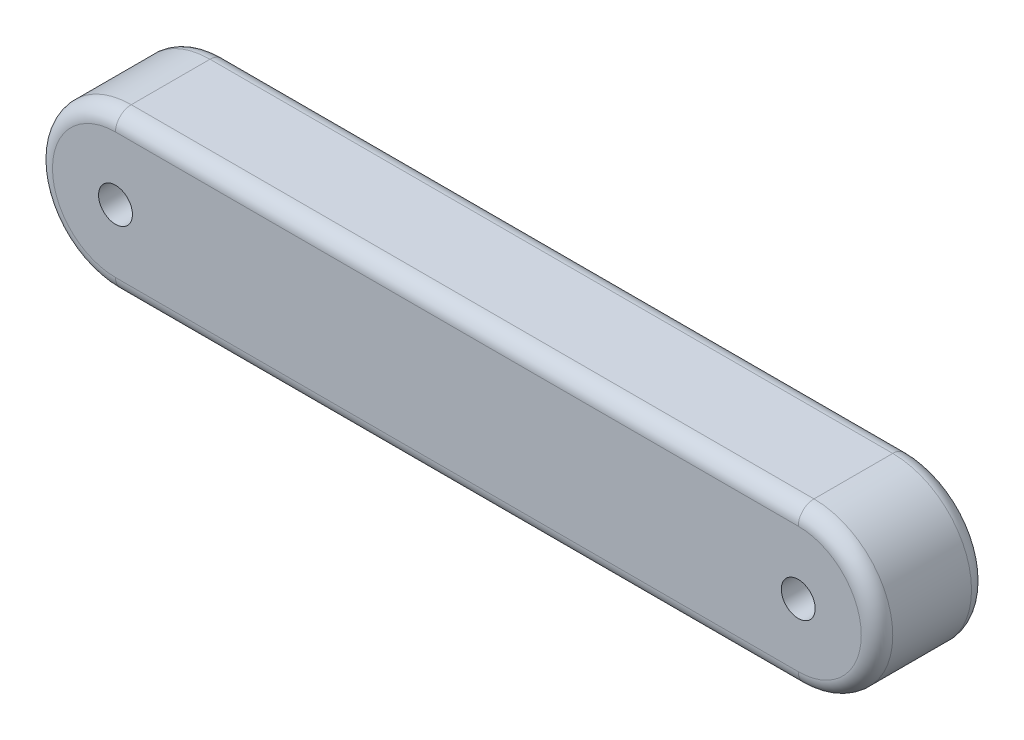
ISO-10303-21;
HEADER;
FILE_DESCRIPTION(('STEP AP214'),'2;1');
FILE_NAME('part.step','',(''),(''),'','','');
FILE_SCHEMA(('AUTOMOTIVE_DESIGN { 1 0 10303 214 1 1 1 1 }'));
ENDSEC;
DATA;
#1=APPLICATION_CONTEXT('core data for automotive mechanical design processes');
#2=APPLICATION_PROTOCOL_DEFINITION('international standard','automotive_design',2000,#1);
#3=PRODUCT_CONTEXT('',#1,'mechanical');
#4=PRODUCT('Part','Part','',(#3));
#5=PRODUCT_RELATED_PRODUCT_CATEGORY('part','',(#4));
#6=PRODUCT_DEFINITION_FORMATION('','',#4);
#7=PRODUCT_DEFINITION_CONTEXT('part definition',#1,'design');
#8=PRODUCT_DEFINITION('design','',#6,#7);
#9=PRODUCT_DEFINITION_SHAPE('','',#8);
#10=(LENGTH_UNIT() NAMED_UNIT(*) SI_UNIT(.MILLI.,.METRE.));
#11=(NAMED_UNIT(*) PLANE_ANGLE_UNIT() SI_UNIT($,.RADIAN.));
#12=(NAMED_UNIT(*) SI_UNIT($,.STERADIAN.) SOLID_ANGLE_UNIT());
#13=UNCERTAINTY_MEASURE_WITH_UNIT(LENGTH_MEASURE(1.E-05),#10,'distance_accuracy_value','');
#14=(GEOMETRIC_REPRESENTATION_CONTEXT(3) GLOBAL_UNCERTAINTY_ASSIGNED_CONTEXT((#13)) GLOBAL_UNIT_ASSIGNED_CONTEXT((#10,
#11,#12)) REPRESENTATION_CONTEXT('',''));
#15=CARTESIAN_POINT('',(0.,0.,0.));
#16=DIRECTION('',(0.,0.,1.));
#17=DIRECTION('',(1.,0.,0.));
#18=AXIS2_PLACEMENT_3D('',#15,#16,#17);
#19=CARTESIAN_POINT('',(43.345,0.,14.));
#20=DIRECTION('',(0.,0.,-1.));
#21=DIRECTION('',(-1.,0.,0.));
#22=AXIS2_PLACEMENT_3D('',#19,#20,#21);
#23=PLANE('',#22);
#24=DIRECTION('',(1.,0.,0.));
#25=VECTOR('',#24,1.);
#26=CARTESIAN_POINT('',(43.345,-8.00000000000001,14.));
#27=LINE('',#26,#25);
#28=CARTESIAN_POINT('',(-43.345,-8.00000000000002,14.));
#29=VERTEX_POINT('',#28);
#30=CARTESIAN_POINT('',(43.345,-8.00000000000001,14.));
#31=VERTEX_POINT('',#30);
#32=EDGE_CURVE('E133',#29,#31,#27,.T.);
#33=ORIENTED_EDGE('',*,*,#32,.T.);
#34=CARTESIAN_POINT('',(43.345,0.,14.));
#35=DIRECTION('',(0.,0.,-1.));
#36=DIRECTION('',(-1.,0.,0.));
#37=AXIS2_PLACEMENT_3D('',#34,#35,#36);
#38=CIRCLE('',#37,8.);
#39=CARTESIAN_POINT('',(43.345,7.99999999999999,14.));
#40=VERTEX_POINT('',#39);
#41=EDGE_CURVE('E114',#31,#40,#38,.F.);
#42=ORIENTED_EDGE('',*,*,#41,.T.);
#43=DIRECTION('',(-1.,0.,0.));
#44=VECTOR('',#43,1.);
#45=CARTESIAN_POINT('',(43.345,7.99999999999999,14.));
#46=LINE('',#45,#44);
#47=CARTESIAN_POINT('',(-43.345,7.99999999999998,14.));
#48=VERTEX_POINT('',#47);
#49=EDGE_CURVE('E122',#40,#48,#46,.T.);
#50=ORIENTED_EDGE('',*,*,#49,.T.);
#51=CARTESIAN_POINT('',(-43.345,0.,14.));
#52=DIRECTION('',(0.,0.,-1.));
#53=DIRECTION('',(-1.,0.,0.));
#54=AXIS2_PLACEMENT_3D('',#51,#52,#53);
#55=CIRCLE('',#54,8.);
#56=EDGE_CURVE('E128',#48,#29,#55,.F.);
#57=ORIENTED_EDGE('',*,*,#56,.T.);
#58=EDGE_LOOP('',(#33,#42,#50,#57));
#59=FACE_BOUND('',#58,.T.);
#60=CARTESIAN_POINT('',(-43.345,0.,14.));
#61=DIRECTION('',(0.,0.,1.));
#62=DIRECTION('',(1.,0.,0.));
#63=AXIS2_PLACEMENT_3D('',#60,#61,#62);
#64=CIRCLE('',#63,2.15);
#65=CARTESIAN_POINT('',(-41.195,0.,14.));
#66=VERTEX_POINT('',#65);
#67=EDGE_CURVE('E212',#66,#66,#64,.T.);
#68=ORIENTED_EDGE('',*,*,#67,.F.);
#69=EDGE_LOOP('',(#68));
#70=FACE_BOUND('',#69,.T.);
#71=CARTESIAN_POINT('',(43.345,0.,14.));
#72=DIRECTION('',(0.,0.,1.));
#73=DIRECTION('',(-1.,0.,0.));
#74=AXIS2_PLACEMENT_3D('',#71,#72,#73);
#75=CIRCLE('',#74,2.15);
#76=CARTESIAN_POINT('',(41.195,0.,14.));
#77=VERTEX_POINT('',#76);
#78=EDGE_CURVE('E219',#77,#77,#75,.T.);
#79=ORIENTED_EDGE('',*,*,#78,.F.);
#80=EDGE_LOOP('',(#79));
#81=FACE_BOUND('',#80,.T.);
#82=ADVANCED_FACE('F41',(#59,#70,#81),#23,.F.);
#83=CARTESIAN_POINT('',(43.345,0.,0.));
#84=DIRECTION('',(0.,0.,-1.));
#85=DIRECTION('',(-1.,0.,0.));
#86=AXIS2_PLACEMENT_3D('',#83,#84,#85);
#87=PLANE('',#86);
#88=DIRECTION('',(-1.,0.,0.));
#89=VECTOR('',#88,1.);
#90=CARTESIAN_POINT('',(43.345,7.99999999999999,0.));
#91=LINE('',#90,#89);
#92=CARTESIAN_POINT('',(-43.345,7.99999999999998,0.));
#93=VERTEX_POINT('',#92);
#94=CARTESIAN_POINT('',(43.345,7.99999999999999,0.));
#95=VERTEX_POINT('',#94);
#96=EDGE_CURVE('E151',#93,#95,#91,.F.);
#97=ORIENTED_EDGE('',*,*,#96,.T.);
#98=CARTESIAN_POINT('',(43.345,0.,0.));
#99=DIRECTION('',(0.,0.,-1.));
#100=DIRECTION('',(-1.,0.,0.));
#101=AXIS2_PLACEMENT_3D('',#98,#99,#100);
#102=CIRCLE('',#101,8.);
#103=CARTESIAN_POINT('',(43.345,-8.00000000000001,0.));
#104=VERTEX_POINT('',#103);
#105=EDGE_CURVE('E156',#95,#104,#102,.T.);
#106=ORIENTED_EDGE('',*,*,#105,.T.);
#107=DIRECTION('',(1.,0.,0.));
#108=VECTOR('',#107,1.);
#109=CARTESIAN_POINT('',(-43.345,-8.00000000000002,0.));
#110=LINE('',#109,#108);
#111=CARTESIAN_POINT('',(-43.345,-8.00000000000002,0.));
#112=VERTEX_POINT('',#111);
#113=EDGE_CURVE('E65',#104,#112,#110,.F.);
#114=ORIENTED_EDGE('',*,*,#113,.T.);
#115=CARTESIAN_POINT('',(-43.345,0.,0.));
#116=DIRECTION('',(0.,0.,-1.));
#117=DIRECTION('',(-1.,0.,0.));
#118=AXIS2_PLACEMENT_3D('',#115,#116,#117);
#119=CIRCLE('',#118,8.);
#120=EDGE_CURVE('E153',#112,#93,#119,.T.);
#121=ORIENTED_EDGE('',*,*,#120,.T.);
#122=EDGE_LOOP('',(#97,#106,#114,#121));
#123=FACE_BOUND('',#122,.T.);
#124=CARTESIAN_POINT('',(-43.345,0.,0.));
#125=DIRECTION('',(0.,0.,1.));
#126=DIRECTION('',(1.,0.,0.));
#127=AXIS2_PLACEMENT_3D('',#124,#125,#126);
#128=CIRCLE('',#127,2.15);
#129=CARTESIAN_POINT('',(-41.195,0.,0.));
#130=VERTEX_POINT('',#129);
#131=EDGE_CURVE('E215',#130,#130,#128,.T.);
#132=ORIENTED_EDGE('',*,*,#131,.T.);
#133=EDGE_LOOP('',(#132));
#134=FACE_BOUND('',#133,.T.);
#135=CARTESIAN_POINT('',(43.345,0.,0.));
#136=DIRECTION('',(0.,0.,1.));
#137=DIRECTION('',(-1.,0.,0.));
#138=AXIS2_PLACEMENT_3D('',#135,#136,#137);
#139=CIRCLE('',#138,2.15);
#140=CARTESIAN_POINT('',(41.195,0.,0.));
#141=VERTEX_POINT('',#140);
#142=EDGE_CURVE('E164',#141,#141,#139,.T.);
#143=ORIENTED_EDGE('',*,*,#142,.T.);
#144=EDGE_LOOP('',(#143));
#145=FACE_BOUND('',#144,.T.);
#146=ADVANCED_FACE('F180',(#123,#134,#145),#87,.T.);
#147=CARTESIAN_POINT('',(43.345,0.,14.));
#148=DIRECTION('',(0.,0.,-1.));
#149=DIRECTION('',(-1.,0.,0.));
#150=AXIS2_PLACEMENT_3D('',#147,#148,#149);
#151=CYLINDRICAL_SURFACE('',#150,10.);
#152=DIRECTION('',(0.,0.,-1.));
#153=VECTOR('',#152,1.);
#154=CARTESIAN_POINT('',(43.345,9.99999999999999,14.));
#155=LINE('',#154,#153);
#156=CARTESIAN_POINT('',(43.345,9.99999999999999,12.));
#157=VERTEX_POINT('',#156);
#158=CARTESIAN_POINT('',(43.345,9.99999999999999,2.));
#159=VERTEX_POINT('',#158);
#160=EDGE_CURVE('E129',#157,#159,#155,.T.);
#161=ORIENTED_EDGE('',*,*,#160,.F.);
#162=CARTESIAN_POINT('',(43.345,0.,12.));
#163=DIRECTION('',(0.,0.,-1.));
#164=DIRECTION('',(-1.,0.,0.));
#165=AXIS2_PLACEMENT_3D('',#162,#163,#164);
#166=CIRCLE('',#165,10.);
#167=CARTESIAN_POINT('',(43.345,-10.,12.));
#168=VERTEX_POINT('',#167);
#169=EDGE_CURVE('E116',#157,#168,#166,.T.);
#170=ORIENTED_EDGE('',*,*,#169,.T.);
#171=DIRECTION('',(0.,0.,-1.));
#172=VECTOR('',#171,1.);
#173=CARTESIAN_POINT('',(43.345,-10.,14.));
#174=LINE('',#173,#172);
#175=CARTESIAN_POINT('',(43.345,-10.,2.));
#176=VERTEX_POINT('',#175);
#177=EDGE_CURVE('E194',#168,#176,#174,.T.);
#178=ORIENTED_EDGE('',*,*,#177,.T.);
#179=CARTESIAN_POINT('',(43.345,0.,2.));
#180=DIRECTION('',(0.,0.,-1.));
#181=DIRECTION('',(-1.,0.,0.));
#182=AXIS2_PLACEMENT_3D('',#179,#180,#181);
#183=CIRCLE('',#182,10.);
#184=EDGE_CURVE('E135',#176,#159,#183,.F.);
#185=ORIENTED_EDGE('',*,*,#184,.T.);
#186=EDGE_LOOP('',(#161,#170,#178,#185));
#187=FACE_BOUND('',#186,.T.);
#188=ADVANCED_FACE('F192',(#187),#151,.T.);
#189=CARTESIAN_POINT('',(-43.345,9.99999999999998,14.));
#190=DIRECTION('',(0.,-1.,0.));
#191=DIRECTION('',(1.,0.,0.));
#192=AXIS2_PLACEMENT_3D('',#189,#190,#191);
#193=PLANE('',#192);
#194=DIRECTION('',(0.,0.,-1.));
#195=VECTOR('',#194,1.);
#196=CARTESIAN_POINT('',(-43.345,9.99999999999998,14.));
#197=LINE('',#196,#195);
#198=CARTESIAN_POINT('',(-43.345,9.99999999999998,12.));
#199=VERTEX_POINT('',#198);
#200=CARTESIAN_POINT('',(-43.345,9.99999999999998,2.));
#201=VERTEX_POINT('',#200);
#202=EDGE_CURVE('E196',#199,#201,#197,.T.);
#203=ORIENTED_EDGE('',*,*,#202,.F.);
#204=DIRECTION('',(-1.,0.,0.));
#205=VECTOR('',#204,1.);
#206=CARTESIAN_POINT('',(-43.345,9.99999999999998,12.));
#207=LINE('',#206,#205);
#208=EDGE_CURVE('E11',#199,#157,#207,.F.);
#209=ORIENTED_EDGE('',*,*,#208,.T.);
#210=ORIENTED_EDGE('',*,*,#160,.T.);
#211=DIRECTION('',(-1.,0.,0.));
#212=VECTOR('',#211,1.);
#213=CARTESIAN_POINT('',(-43.345,9.99999999999998,2.));
#214=LINE('',#213,#212);
#215=EDGE_CURVE('E50',#159,#201,#214,.T.);
#216=ORIENTED_EDGE('',*,*,#215,.T.);
#217=EDGE_LOOP('',(#203,#209,#210,#216));
#218=FACE_BOUND('',#217,.T.);
#219=ADVANCED_FACE('F195',(#218),#193,.F.);
#220=CARTESIAN_POINT('',(-43.345,0.,14.));
#221=DIRECTION('',(0.,0.,-1.));
#222=DIRECTION('',(-1.,0.,0.));
#223=AXIS2_PLACEMENT_3D('',#220,#221,#222);
#224=CYLINDRICAL_SURFACE('',#223,10.);
#225=DIRECTION('',(0.,0.,-1.));
#226=VECTOR('',#225,1.);
#227=CARTESIAN_POINT('',(-43.345,-10.,14.));
#228=LINE('',#227,#226);
#229=CARTESIAN_POINT('',(-43.345,-10.,12.));
#230=VERTEX_POINT('',#229);
#231=CARTESIAN_POINT('',(-43.345,-10.,2.));
#232=VERTEX_POINT('',#231);
#233=EDGE_CURVE('E198',#230,#232,#228,.T.);
#234=ORIENTED_EDGE('',*,*,#233,.F.);
#235=CARTESIAN_POINT('',(-43.345,0.,12.));
#236=DIRECTION('',(0.,0.,-1.));
#237=DIRECTION('',(-1.,0.,0.));
#238=AXIS2_PLACEMENT_3D('',#235,#236,#237);
#239=CIRCLE('',#238,10.);
#240=EDGE_CURVE('E149',#230,#199,#239,.T.);
#241=ORIENTED_EDGE('',*,*,#240,.T.);
#242=ORIENTED_EDGE('',*,*,#202,.T.);
#243=CARTESIAN_POINT('',(-43.345,0.,2.));
#244=DIRECTION('',(0.,0.,-1.));
#245=DIRECTION('',(-1.,0.,0.));
#246=AXIS2_PLACEMENT_3D('',#243,#244,#245);
#247=CIRCLE('',#246,10.);
#248=EDGE_CURVE('E147',#201,#232,#247,.F.);
#249=ORIENTED_EDGE('',*,*,#248,.T.);
#250=EDGE_LOOP('',(#234,#241,#242,#249));
#251=FACE_BOUND('',#250,.T.);
#252=ADVANCED_FACE('F242',(#251),#224,.T.);
#253=CARTESIAN_POINT('',(-43.345,-10.,14.));
#254=DIRECTION('',(0.,1.,0.));
#255=DIRECTION('',(-1.,0.,0.));
#256=AXIS2_PLACEMENT_3D('',#253,#254,#255);
#257=PLANE('',#256);
#258=ORIENTED_EDGE('',*,*,#177,.F.);
#259=DIRECTION('',(1.,0.,0.));
#260=VECTOR('',#259,1.);
#261=CARTESIAN_POINT('',(-43.345,-10.,12.));
#262=LINE('',#261,#260);
#263=EDGE_CURVE('E145',#168,#230,#262,.F.);
#264=ORIENTED_EDGE('',*,*,#263,.T.);
#265=ORIENTED_EDGE('',*,*,#233,.T.);
#266=DIRECTION('',(1.,0.,0.));
#267=VECTOR('',#266,1.);
#268=CARTESIAN_POINT('',(43.345,-10.,2.));
#269=LINE('',#268,#267);
#270=EDGE_CURVE('E143',#232,#176,#269,.T.);
#271=ORIENTED_EDGE('',*,*,#270,.T.);
#272=EDGE_LOOP('',(#258,#264,#265,#271));
#273=FACE_BOUND('',#272,.T.);
#274=ADVANCED_FACE('F211',(#273),#257,.F.);
#275=CARTESIAN_POINT('',(-43.345,0.,14.));
#276=DIRECTION('',(0.,0.,-1.));
#277=DIRECTION('',(-1.,0.,0.));
#278=AXIS2_PLACEMENT_3D('',#275,#276,#277);
#279=CYLINDRICAL_SURFACE('',#278,2.15);
#280=ORIENTED_EDGE('',*,*,#67,.T.);
#281=EDGE_LOOP('',(#280));
#282=FACE_BOUND('',#281,.T.);
#283=ORIENTED_EDGE('',*,*,#131,.F.);
#284=EDGE_LOOP('',(#283));
#285=FACE_BOUND('',#284,.T.);
#286=ADVANCED_FACE('F237',(#282,#285),#279,.F.);
#287=CARTESIAN_POINT('',(43.345,0.,14.));
#288=DIRECTION('',(0.,0.,-1.));
#289=DIRECTION('',(-1.,0.,0.));
#290=AXIS2_PLACEMENT_3D('',#287,#288,#289);
#291=CYLINDRICAL_SURFACE('',#290,2.15);
#292=ORIENTED_EDGE('',*,*,#78,.T.);
#293=EDGE_LOOP('',(#292));
#294=FACE_BOUND('',#293,.T.);
#295=ORIENTED_EDGE('',*,*,#142,.F.);
#296=EDGE_LOOP('',(#295));
#297=FACE_BOUND('',#296,.T.);
#298=ADVANCED_FACE('F226',(#294,#297),#291,.F.);
#299=CARTESIAN_POINT('',(-43.345,0.,12.));
#300=DIRECTION('',(0.,0.,-1.));
#301=DIRECTION('',(-1.,0.,0.));
#302=AXIS2_PLACEMENT_3D('',#299,#300,#301);
#303=TOROIDAL_SURFACE('',#302,8.,2.);
#304=CARTESIAN_POINT('',(-43.345,7.99999999999998,12.));
#305=DIRECTION('',(1.,0.,0.));
#306=DIRECTION('',(0.,0.,-1.));
#307=AXIS2_PLACEMENT_3D('',#304,#305,#306);
#308=CIRCLE('',#307,2.);
#309=EDGE_CURVE('E125',#199,#48,#308,.T.);
#310=ORIENTED_EDGE('',*,*,#309,.F.);
#311=ORIENTED_EDGE('',*,*,#240,.F.);
#312=CARTESIAN_POINT('',(-43.345,-8.00000000000002,12.));
#313=DIRECTION('',(1.,0.,0.));
#314=DIRECTION('',(0.,0.,-1.));
#315=AXIS2_PLACEMENT_3D('',#312,#313,#314);
#316=CIRCLE('',#315,2.);
#317=EDGE_CURVE('E161',#29,#230,#316,.T.);
#318=ORIENTED_EDGE('',*,*,#317,.F.);
#319=ORIENTED_EDGE('',*,*,#56,.F.);
#320=EDGE_LOOP('',(#310,#311,#318,#319));
#321=FACE_BOUND('',#320,.T.);
#322=ADVANCED_FACE('F204',(#321),#303,.T.);
#323=CARTESIAN_POINT('',(43.345,-8.00000000000001,12.));
#324=DIRECTION('',(1.,0.,0.));
#325=DIRECTION('',(0.,1.,0.));
#326=AXIS2_PLACEMENT_3D('',#323,#324,#325);
#327=CYLINDRICAL_SURFACE('',#326,2.);
#328=ORIENTED_EDGE('',*,*,#317,.T.);
#329=ORIENTED_EDGE('',*,*,#263,.F.);
#330=CARTESIAN_POINT('',(43.345,-8.00000000000001,12.));
#331=DIRECTION('',(1.,0.,0.));
#332=DIRECTION('',(0.,1.,0.));
#333=AXIS2_PLACEMENT_3D('',#330,#331,#332);
#334=CIRCLE('',#333,2.);
#335=EDGE_CURVE('E119',#31,#168,#334,.T.);
#336=ORIENTED_EDGE('',*,*,#335,.F.);
#337=ORIENTED_EDGE('',*,*,#32,.F.);
#338=EDGE_LOOP('',(#328,#329,#336,#337));
#339=FACE_BOUND('',#338,.T.);
#340=ADVANCED_FACE('F207',(#339),#327,.T.);
#341=CARTESIAN_POINT('',(43.345,7.99999999999999,12.));
#342=DIRECTION('',(-1.,0.,0.));
#343=DIRECTION('',(0.,-1.,0.));
#344=AXIS2_PLACEMENT_3D('',#341,#342,#343);
#345=CYLINDRICAL_SURFACE('',#344,2.);
#346=ORIENTED_EDGE('',*,*,#309,.T.);
#347=ORIENTED_EDGE('',*,*,#49,.F.);
#348=CARTESIAN_POINT('',(43.345,7.99999999999999,12.));
#349=DIRECTION('',(1.,0.,0.));
#350=DIRECTION('',(0.,0.,-1.));
#351=AXIS2_PLACEMENT_3D('',#348,#349,#350);
#352=CIRCLE('',#351,2.);
#353=EDGE_CURVE('E110',#157,#40,#352,.T.);
#354=ORIENTED_EDGE('',*,*,#353,.F.);
#355=ORIENTED_EDGE('',*,*,#208,.F.);
#356=EDGE_LOOP('',(#346,#347,#354,#355));
#357=FACE_BOUND('',#356,.T.);
#358=ADVANCED_FACE('F123',(#357),#345,.T.);
#359=CARTESIAN_POINT('',(43.345,0.,12.));
#360=DIRECTION('',(0.,0.,-1.));
#361=DIRECTION('',(-1.,0.,0.));
#362=AXIS2_PLACEMENT_3D('',#359,#360,#361);
#363=TOROIDAL_SURFACE('',#362,8.,2.);
#364=ORIENTED_EDGE('',*,*,#335,.T.);
#365=ORIENTED_EDGE('',*,*,#169,.F.);
#366=ORIENTED_EDGE('',*,*,#353,.T.);
#367=ORIENTED_EDGE('',*,*,#41,.F.);
#368=EDGE_LOOP('',(#364,#365,#366,#367));
#369=FACE_BOUND('',#368,.T.);
#370=ADVANCED_FACE('F112',(#369),#363,.T.);
#371=CARTESIAN_POINT('',(-43.345,0.,2.));
#372=DIRECTION('',(0.,0.,-1.));
#373=DIRECTION('',(-1.,0.,0.));
#374=AXIS2_PLACEMENT_3D('',#371,#372,#373);
#375=TOROIDAL_SURFACE('',#374,8.,2.);
#376=CARTESIAN_POINT('',(-43.345,7.99999999999998,2.));
#377=DIRECTION('',(1.,0.,0.));
#378=DIRECTION('',(0.,0.,-1.));
#379=AXIS2_PLACEMENT_3D('',#376,#377,#378);
#380=CIRCLE('',#379,2.);
#381=EDGE_CURVE('E167',#93,#201,#380,.T.);
#382=ORIENTED_EDGE('',*,*,#381,.F.);
#383=ORIENTED_EDGE('',*,*,#120,.F.);
#384=CARTESIAN_POINT('',(-43.345,-8.00000000000002,2.));
#385=DIRECTION('',(1.,0.,0.));
#386=DIRECTION('',(0.,0.,-1.));
#387=AXIS2_PLACEMENT_3D('',#384,#385,#386);
#388=CIRCLE('',#387,2.);
#389=EDGE_CURVE('E45',#232,#112,#388,.T.);
#390=ORIENTED_EDGE('',*,*,#389,.F.);
#391=ORIENTED_EDGE('',*,*,#248,.F.);
#392=EDGE_LOOP('',(#382,#383,#390,#391));
#393=FACE_BOUND('',#392,.T.);
#394=ADVANCED_FACE('F43',(#393),#375,.T.);
#395=CARTESIAN_POINT('',(-43.345,-8.00000000000002,2.));
#396=DIRECTION('',(-1.,0.,0.));
#397=DIRECTION('',(0.,-1.,0.));
#398=AXIS2_PLACEMENT_3D('',#395,#396,#397);
#399=CYLINDRICAL_SURFACE('',#398,2.);
#400=ORIENTED_EDGE('',*,*,#389,.T.);
#401=ORIENTED_EDGE('',*,*,#113,.F.);
#402=CARTESIAN_POINT('',(43.345,-8.00000000000001,2.));
#403=DIRECTION('',(1.,0.,0.));
#404=DIRECTION('',(0.,0.,-1.));
#405=AXIS2_PLACEMENT_3D('',#402,#403,#404);
#406=CIRCLE('',#405,2.);
#407=EDGE_CURVE('E58',#176,#104,#406,.T.);
#408=ORIENTED_EDGE('',*,*,#407,.F.);
#409=ORIENTED_EDGE('',*,*,#270,.F.);
#410=EDGE_LOOP('',(#400,#401,#408,#409));
#411=FACE_BOUND('',#410,.T.);
#412=ADVANCED_FACE('F177',(#411),#399,.T.);
#413=CARTESIAN_POINT('',(-43.345,7.99999999999998,2.));
#414=DIRECTION('',(1.,0.,0.));
#415=DIRECTION('',(0.,1.,0.));
#416=AXIS2_PLACEMENT_3D('',#413,#414,#415);
#417=CYLINDRICAL_SURFACE('',#416,2.);
#418=ORIENTED_EDGE('',*,*,#381,.T.);
#419=ORIENTED_EDGE('',*,*,#215,.F.);
#420=CARTESIAN_POINT('',(43.345,7.99999999999999,2.));
#421=DIRECTION('',(1.,0.,0.));
#422=DIRECTION('',(0.,0.,-1.));
#423=AXIS2_PLACEMENT_3D('',#420,#421,#422);
#424=CIRCLE('',#423,2.);
#425=EDGE_CURVE('E165',#95,#159,#424,.T.);
#426=ORIENTED_EDGE('',*,*,#425,.F.);
#427=ORIENTED_EDGE('',*,*,#96,.F.);
#428=EDGE_LOOP('',(#418,#419,#426,#427));
#429=FACE_BOUND('',#428,.T.);
#430=ADVANCED_FACE('F184',(#429),#417,.T.);
#431=CARTESIAN_POINT('',(43.345,0.,2.));
#432=DIRECTION('',(0.,0.,-1.));
#433=DIRECTION('',(-1.,0.,0.));
#434=AXIS2_PLACEMENT_3D('',#431,#432,#433);
#435=TOROIDAL_SURFACE('',#434,8.,2.);
#436=ORIENTED_EDGE('',*,*,#407,.T.);
#437=ORIENTED_EDGE('',*,*,#105,.F.);
#438=ORIENTED_EDGE('',*,*,#425,.T.);
#439=ORIENTED_EDGE('',*,*,#184,.F.);
#440=EDGE_LOOP('',(#436,#437,#438,#439));
#441=FACE_BOUND('',#440,.T.);
#442=ADVANCED_FACE('F183',(#441),#435,.T.);
#443=CLOSED_SHELL('',(#82,#146,#188,#219,#252,#274,#286,#298,#322,#340,#358,#370,#394,#412,#430,#442));
#444=MANIFOLD_SOLID_BREP('B2',#443);
#445=ADVANCED_BREP_SHAPE_REPRESENTATION('',(#18,#444),#14);
#446=SHAPE_DEFINITION_REPRESENTATION(#9,#445);
ENDSEC;
END-ISO-10303-21;
